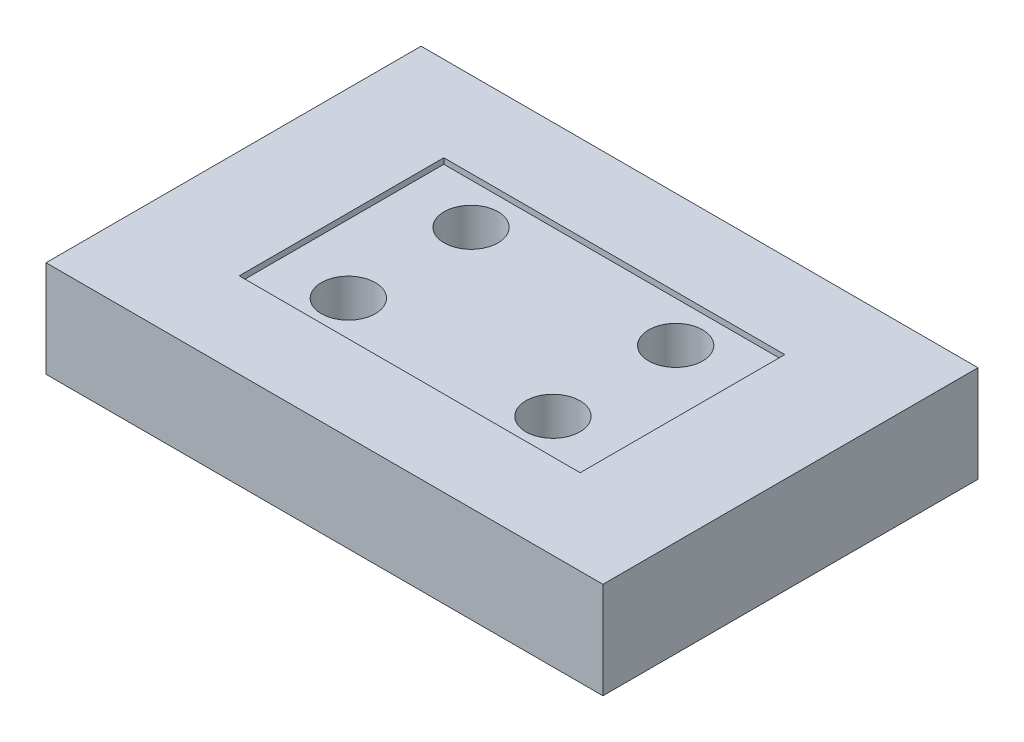
ISO-10303-21;
HEADER;
FILE_DESCRIPTION(('STEP AP214'),'2;1');
FILE_NAME('part.step','',(''),(''),'','','');
FILE_SCHEMA(('AUTOMOTIVE_DESIGN { 1 0 10303 214 1 1 1 1 }'));
ENDSEC;
DATA;
#1=APPLICATION_CONTEXT('core data for automotive mechanical design processes');
#2=APPLICATION_PROTOCOL_DEFINITION('international standard','automotive_design',2000,#1);
#3=PRODUCT_CONTEXT('',#1,'mechanical');
#4=PRODUCT('Part','Part','',(#3));
#5=PRODUCT_RELATED_PRODUCT_CATEGORY('part','',(#4));
#6=PRODUCT_DEFINITION_FORMATION('','',#4);
#7=PRODUCT_DEFINITION_CONTEXT('part definition',#1,'design');
#8=PRODUCT_DEFINITION('design','',#6,#7);
#9=PRODUCT_DEFINITION_SHAPE('','',#8);
#10=(LENGTH_UNIT() NAMED_UNIT(*) SI_UNIT(.MILLI.,.METRE.));
#11=(NAMED_UNIT(*) PLANE_ANGLE_UNIT() SI_UNIT($,.RADIAN.));
#12=(NAMED_UNIT(*) SI_UNIT($,.STERADIAN.) SOLID_ANGLE_UNIT());
#13=UNCERTAINTY_MEASURE_WITH_UNIT(LENGTH_MEASURE(1.E-05),#10,'distance_accuracy_value','');
#14=(GEOMETRIC_REPRESENTATION_CONTEXT(3) GLOBAL_UNCERTAINTY_ASSIGNED_CONTEXT((#13)) GLOBAL_UNIT_ASSIGNED_CONTEXT((#10,
#11,#12)) REPRESENTATION_CONTEXT('',''));
#15=CARTESIAN_POINT('',(0.,0.,0.));
#16=DIRECTION('',(0.,0.,1.));
#17=DIRECTION('',(1.,0.,0.));
#18=AXIS2_PLACEMENT_3D('',#15,#16,#17);
#19=CARTESIAN_POINT('',(-114.3,0.,-68.58));
#20=DIRECTION('',(0.,1.,0.));
#21=DIRECTION('',(0.,0.,1.));
#22=AXIS2_PLACEMENT_3D('',#19,#20,#21);
#23=CYLINDRICAL_SURFACE('',#22,30.1625);
#24=CARTESIAN_POINT('',(-114.3,0.,-68.58));
#25=DIRECTION('',(0.,1.,0.));
#26=DIRECTION('',(0.,0.,1.));
#27=AXIS2_PLACEMENT_3D('',#24,#25,#26);
#28=CIRCLE('',#27,30.1625);
#29=CARTESIAN_POINT('',(-114.3,0.,-38.4175));
#30=VERTEX_POINT('',#29);
#31=EDGE_CURVE('E178',#30,#30,#28,.T.);
#32=ORIENTED_EDGE('',*,*,#31,.F.);
#33=EDGE_LOOP('',(#32));
#34=FACE_BOUND('',#33,.T.);
#35=CARTESIAN_POINT('',(-114.3,101.6,-68.58));
#36=DIRECTION('',(0.,1.,0.));
#37=DIRECTION('',(0.,0.,1.));
#38=AXIS2_PLACEMENT_3D('',#35,#36,#37);
#39=CIRCLE('',#38,30.1625);
#40=CARTESIAN_POINT('',(-114.3,101.6,-38.4175));
#41=VERTEX_POINT('',#40);
#42=EDGE_CURVE('E168',#41,#41,#39,.F.);
#43=ORIENTED_EDGE('',*,*,#42,.F.);
#44=EDGE_LOOP('',(#43));
#45=FACE_BOUND('',#44,.T.);
#46=ADVANCED_FACE('F48',(#34,#45),#23,.F.);
#47=CARTESIAN_POINT('',(114.3,0.,68.5799999999991));
#48=DIRECTION('',(0.,1.,0.));
#49=DIRECTION('',(0.,0.,1.));
#50=AXIS2_PLACEMENT_3D('',#47,#48,#49);
#51=CYLINDRICAL_SURFACE('',#50,30.1625);
#52=CARTESIAN_POINT('',(114.3,0.,68.5799999999991));
#53=DIRECTION('',(0.,1.,0.));
#54=DIRECTION('',(0.,0.,1.));
#55=AXIS2_PLACEMENT_3D('',#52,#53,#54);
#56=CIRCLE('',#55,30.1625);
#57=CARTESIAN_POINT('',(114.3,0.,98.7424999999991));
#58=VERTEX_POINT('',#57);
#59=EDGE_CURVE('E171',#58,#58,#56,.T.);
#60=ORIENTED_EDGE('',*,*,#59,.F.);
#61=EDGE_LOOP('',(#60));
#62=FACE_BOUND('',#61,.T.);
#63=CARTESIAN_POINT('',(114.3,101.6,68.5799999999991));
#64=DIRECTION('',(0.,1.,0.));
#65=DIRECTION('',(0.,0.,1.));
#66=AXIS2_PLACEMENT_3D('',#63,#64,#65);
#67=CIRCLE('',#66,30.1625);
#68=CARTESIAN_POINT('',(114.3,101.6,98.7424999999991));
#69=VERTEX_POINT('',#68);
#70=EDGE_CURVE('E165',#69,#69,#67,.F.);
#71=ORIENTED_EDGE('',*,*,#70,.F.);
#72=EDGE_LOOP('',(#71));
#73=FACE_BOUND('',#72,.T.);
#74=ADVANCED_FACE('F227',(#62,#73),#51,.F.);
#75=CARTESIAN_POINT('',(114.299999999999,0.,-68.5800000000009));
#76=DIRECTION('',(0.,1.,0.));
#77=DIRECTION('',(0.,0.,1.));
#78=AXIS2_PLACEMENT_3D('',#75,#76,#77);
#79=CYLINDRICAL_SURFACE('',#78,30.1624999999999);
#80=CARTESIAN_POINT('',(114.299999999999,0.,-68.5800000000009));
#81=DIRECTION('',(0.,1.,0.));
#82=DIRECTION('',(0.,0.,-1.));
#83=AXIS2_PLACEMENT_3D('',#80,#81,#82);
#84=CIRCLE('',#83,30.1624999999999);
#85=CARTESIAN_POINT('',(114.299999999999,0.,-98.7425000000008));
#86=VERTEX_POINT('',#85);
#87=EDGE_CURVE('E174',#86,#86,#84,.T.);
#88=ORIENTED_EDGE('',*,*,#87,.F.);
#89=EDGE_LOOP('',(#88));
#90=FACE_BOUND('',#89,.T.);
#91=CARTESIAN_POINT('',(114.299999999999,101.6,-68.5800000000009));
#92=DIRECTION('',(0.,1.,0.));
#93=DIRECTION('',(0.,0.,1.));
#94=AXIS2_PLACEMENT_3D('',#91,#92,#93);
#95=CIRCLE('',#94,30.1624999999999);
#96=CARTESIAN_POINT('',(114.299999999999,101.6,-38.417500000001));
#97=VERTEX_POINT('',#96);
#98=EDGE_CURVE('E162',#97,#97,#95,.F.);
#99=ORIENTED_EDGE('',*,*,#98,.F.);
#100=EDGE_LOOP('',(#99));
#101=FACE_BOUND('',#100,.T.);
#102=ADVANCED_FACE('F233',(#90,#101),#79,.F.);
#103=CARTESIAN_POINT('',(-114.3,0.,68.58));
#104=DIRECTION('',(0.,1.,0.));
#105=DIRECTION('',(0.,0.,1.));
#106=AXIS2_PLACEMENT_3D('',#103,#104,#105);
#107=CYLINDRICAL_SURFACE('',#106,30.1625);
#108=CARTESIAN_POINT('',(-114.3,0.,68.58));
#109=DIRECTION('',(0.,1.,0.));
#110=DIRECTION('',(0.,0.,-1.));
#111=AXIS2_PLACEMENT_3D('',#108,#109,#110);
#112=CIRCLE('',#111,30.1625);
#113=CARTESIAN_POINT('',(-114.3,0.,38.4175));
#114=VERTEX_POINT('',#113);
#115=EDGE_CURVE('E175',#114,#114,#112,.T.);
#116=ORIENTED_EDGE('',*,*,#115,.F.);
#117=EDGE_LOOP('',(#116));
#118=FACE_BOUND('',#117,.T.);
#119=CARTESIAN_POINT('',(-114.3,101.6,68.58));
#120=DIRECTION('',(0.,1.,0.));
#121=DIRECTION('',(0.,0.,1.));
#122=AXIS2_PLACEMENT_3D('',#119,#120,#121);
#123=CIRCLE('',#122,30.1625);
#124=CARTESIAN_POINT('',(-114.3,101.6,98.7425));
#125=VERTEX_POINT('',#124);
#126=EDGE_CURVE('E52',#125,#125,#123,.F.);
#127=ORIENTED_EDGE('',*,*,#126,.F.);
#128=EDGE_LOOP('',(#127));
#129=FACE_BOUND('',#128,.T.);
#130=ADVANCED_FACE('F260',(#118,#129),#107,.F.);
#131=CARTESIAN_POINT('',(-311.15,107.95,209.55));
#132=DIRECTION('',(1.,0.,0.));
#133=DIRECTION('',(0.,0.,-1.));
#134=AXIS2_PLACEMENT_3D('',#131,#132,#133);
#135=PLANE('',#134);
#136=DIRECTION('',(0.,0.,1.));
#137=VECTOR('',#136,1.);
#138=CARTESIAN_POINT('',(-311.15,0.,209.55));
#139=LINE('',#138,#137);
#140=CARTESIAN_POINT('',(-311.15,0.,-209.55));
#141=VERTEX_POINT('',#140);
#142=CARTESIAN_POINT('',(-311.15,0.,209.55));
#143=VERTEX_POINT('',#142);
#144=EDGE_CURVE('E183',#141,#143,#139,.T.);
#145=ORIENTED_EDGE('',*,*,#144,.T.);
#146=DIRECTION('',(0.,-1.,0.));
#147=VECTOR('',#146,1.);
#148=CARTESIAN_POINT('',(-311.15,107.95,209.55));
#149=LINE('',#148,#147);
#150=CARTESIAN_POINT('',(-311.15,107.95,209.55));
#151=VERTEX_POINT('',#150);
#152=EDGE_CURVE('E13',#151,#143,#149,.T.);
#153=ORIENTED_EDGE('',*,*,#152,.F.);
#154=DIRECTION('',(0.,0.,1.));
#155=VECTOR('',#154,1.);
#156=CARTESIAN_POINT('',(-311.15,107.95,209.55));
#157=LINE('',#156,#155);
#158=CARTESIAN_POINT('',(-311.15,107.95,-209.55));
#159=VERTEX_POINT('',#158);
#160=EDGE_CURVE('E184',#159,#151,#157,.T.);
#161=ORIENTED_EDGE('',*,*,#160,.F.);
#162=DIRECTION('',(0.,-1.,0.));
#163=VECTOR('',#162,1.);
#164=CARTESIAN_POINT('',(-311.15,107.95,-209.55));
#165=LINE('',#164,#163);
#166=EDGE_CURVE('E190',#159,#141,#165,.T.);
#167=ORIENTED_EDGE('',*,*,#166,.T.);
#168=EDGE_LOOP('',(#145,#153,#161,#167));
#169=FACE_BOUND('',#168,.T.);
#170=ADVANCED_FACE('F50',(#169),#135,.F.);
#171=CARTESIAN_POINT('',(311.15,107.95,209.55));
#172=DIRECTION('',(0.,0.,-1.));
#173=DIRECTION('',(-1.,0.,0.));
#174=AXIS2_PLACEMENT_3D('',#171,#172,#173);
#175=PLANE('',#174);
#176=DIRECTION('',(1.,0.,0.));
#177=VECTOR('',#176,1.);
#178=CARTESIAN_POINT('',(311.15,0.,209.55));
#179=LINE('',#178,#177);
#180=CARTESIAN_POINT('',(311.15,0.,209.55));
#181=VERTEX_POINT('',#180);
#182=EDGE_CURVE('E193',#143,#181,#179,.T.);
#183=ORIENTED_EDGE('',*,*,#182,.T.);
#184=DIRECTION('',(0.,-1.,0.));
#185=VECTOR('',#184,1.);
#186=CARTESIAN_POINT('',(311.15,107.95,209.55));
#187=LINE('',#186,#185);
#188=CARTESIAN_POINT('',(311.15,107.95,209.55));
#189=VERTEX_POINT('',#188);
#190=EDGE_CURVE('E57',#189,#181,#187,.T.);
#191=ORIENTED_EDGE('',*,*,#190,.F.);
#192=DIRECTION('',(1.,0.,0.));
#193=VECTOR('',#192,1.);
#194=CARTESIAN_POINT('',(311.15,107.95,209.55));
#195=LINE('',#194,#193);
#196=EDGE_CURVE('E101',#151,#189,#195,.T.);
#197=ORIENTED_EDGE('',*,*,#196,.F.);
#198=ORIENTED_EDGE('',*,*,#152,.T.);
#199=EDGE_LOOP('',(#183,#191,#197,#198));
#200=FACE_BOUND('',#199,.T.);
#201=ADVANCED_FACE('F223',(#200),#175,.F.);
#202=CARTESIAN_POINT('',(311.15,107.95,209.55));
#203=DIRECTION('',(-1.,0.,0.));
#204=DIRECTION('',(0.,0.,1.));
#205=AXIS2_PLACEMENT_3D('',#202,#203,#204);
#206=PLANE('',#205);
#207=DIRECTION('',(0.,0.,-1.));
#208=VECTOR('',#207,1.);
#209=CARTESIAN_POINT('',(311.15,0.,209.55));
#210=LINE('',#209,#208);
#211=CARTESIAN_POINT('',(311.15,0.,-209.55));
#212=VERTEX_POINT('',#211);
#213=EDGE_CURVE('E195',#181,#212,#210,.T.);
#214=ORIENTED_EDGE('',*,*,#213,.T.);
#215=DIRECTION('',(0.,-1.,0.));
#216=VECTOR('',#215,1.);
#217=CARTESIAN_POINT('',(311.15,107.95,-209.55));
#218=LINE('',#217,#216);
#219=CARTESIAN_POINT('',(311.15,107.95,-209.55));
#220=VERTEX_POINT('',#219);
#221=EDGE_CURVE('E199',#220,#212,#218,.T.);
#222=ORIENTED_EDGE('',*,*,#221,.F.);
#223=DIRECTION('',(0.,0.,-1.));
#224=VECTOR('',#223,1.);
#225=CARTESIAN_POINT('',(311.15,107.95,209.55));
#226=LINE('',#225,#224);
#227=EDGE_CURVE('E187',#189,#220,#226,.T.);
#228=ORIENTED_EDGE('',*,*,#227,.F.);
#229=ORIENTED_EDGE('',*,*,#190,.T.);
#230=EDGE_LOOP('',(#214,#222,#228,#229));
#231=FACE_BOUND('',#230,.T.);
#232=ADVANCED_FACE('F205',(#231),#206,.F.);
#233=CARTESIAN_POINT('',(311.15,107.95,-209.55));
#234=DIRECTION('',(0.,0.,1.));
#235=DIRECTION('',(1.,0.,0.));
#236=AXIS2_PLACEMENT_3D('',#233,#234,#235);
#237=PLANE('',#236);
#238=DIRECTION('',(-1.,0.,0.));
#239=VECTOR('',#238,1.);
#240=CARTESIAN_POINT('',(311.15,0.,-209.55));
#241=LINE('',#240,#239);
#242=EDGE_CURVE('E94',#212,#141,#241,.T.);
#243=ORIENTED_EDGE('',*,*,#242,.T.);
#244=ORIENTED_EDGE('',*,*,#166,.F.);
#245=DIRECTION('',(-1.,0.,0.));
#246=VECTOR('',#245,1.);
#247=CARTESIAN_POINT('',(311.15,107.95,-209.55));
#248=LINE('',#247,#246);
#249=EDGE_CURVE('E73',#220,#159,#248,.T.);
#250=ORIENTED_EDGE('',*,*,#249,.F.);
#251=ORIENTED_EDGE('',*,*,#221,.T.);
#252=EDGE_LOOP('',(#243,#244,#250,#251));
#253=FACE_BOUND('',#252,.T.);
#254=ADVANCED_FACE('F213',(#253),#237,.F.);
#255=CARTESIAN_POINT('',(0.,107.95,0.));
#256=DIRECTION('',(0.,1.,0.));
#257=DIRECTION('',(0.,0.,1.));
#258=AXIS2_PLACEMENT_3D('',#255,#256,#257);
#259=PLANE('',#258);
#260=DIRECTION('',(0.,0.,1.));
#261=VECTOR('',#260,1.);
#262=CARTESIAN_POINT('',(-190.5,107.95,114.3));
#263=LINE('',#262,#261);
#264=CARTESIAN_POINT('',(-190.5,107.95,-114.3));
#265=VERTEX_POINT('',#264);
#266=CARTESIAN_POINT('',(-190.5,107.95,114.3));
#267=VERTEX_POINT('',#266);
#268=EDGE_CURVE('E64',#265,#267,#263,.T.);
#269=ORIENTED_EDGE('',*,*,#268,.F.);
#270=DIRECTION('',(-1.,0.,0.));
#271=VECTOR('',#270,1.);
#272=CARTESIAN_POINT('',(190.5,107.95,-114.3));
#273=LINE('',#272,#271);
#274=CARTESIAN_POINT('',(190.5,107.95,-114.3));
#275=VERTEX_POINT('',#274);
#276=EDGE_CURVE('E144',#275,#265,#273,.T.);
#277=ORIENTED_EDGE('',*,*,#276,.F.);
#278=DIRECTION('',(0.,0.,-1.));
#279=VECTOR('',#278,1.);
#280=CARTESIAN_POINT('',(190.5,107.95,114.3));
#281=LINE('',#280,#279);
#282=CARTESIAN_POINT('',(190.5,107.95,114.3));
#283=VERTEX_POINT('',#282);
#284=EDGE_CURVE('E147',#283,#275,#281,.T.);
#285=ORIENTED_EDGE('',*,*,#284,.F.);
#286=DIRECTION('',(1.,0.,0.));
#287=VECTOR('',#286,1.);
#288=CARTESIAN_POINT('',(190.5,107.95,114.3));
#289=LINE('',#288,#287);
#290=EDGE_CURVE('E153',#267,#283,#289,.T.);
#291=ORIENTED_EDGE('',*,*,#290,.F.);
#292=EDGE_LOOP('',(#269,#277,#285,#291));
#293=FACE_BOUND('',#292,.T.);
#294=ORIENTED_EDGE('',*,*,#160,.T.);
#295=ORIENTED_EDGE('',*,*,#196,.T.);
#296=ORIENTED_EDGE('',*,*,#227,.T.);
#297=ORIENTED_EDGE('',*,*,#249,.T.);
#298=EDGE_LOOP('',(#294,#295,#296,#297));
#299=FACE_BOUND('',#298,.T.);
#300=ADVANCED_FACE('F215',(#293,#299),#259,.T.);
#301=CARTESIAN_POINT('',(0.,0.,0.));
#302=DIRECTION('',(0.,1.,0.));
#303=DIRECTION('',(0.,0.,1.));
#304=AXIS2_PLACEMENT_3D('',#301,#302,#303);
#305=PLANE('',#304);
#306=ORIENTED_EDGE('',*,*,#115,.T.);
#307=EDGE_LOOP('',(#306));
#308=FACE_BOUND('',#307,.T.);
#309=ORIENTED_EDGE('',*,*,#87,.T.);
#310=EDGE_LOOP('',(#309));
#311=FACE_BOUND('',#310,.T.);
#312=ORIENTED_EDGE('',*,*,#59,.T.);
#313=EDGE_LOOP('',(#312));
#314=FACE_BOUND('',#313,.T.);
#315=ORIENTED_EDGE('',*,*,#31,.T.);
#316=EDGE_LOOP('',(#315));
#317=FACE_BOUND('',#316,.T.);
#318=ORIENTED_EDGE('',*,*,#144,.F.);
#319=ORIENTED_EDGE('',*,*,#242,.F.);
#320=ORIENTED_EDGE('',*,*,#213,.F.);
#321=ORIENTED_EDGE('',*,*,#182,.F.);
#322=EDGE_LOOP('',(#318,#319,#320,#321));
#323=FACE_BOUND('',#322,.T.);
#324=ADVANCED_FACE('F209',(#308,#311,#314,#317,#323),#305,.F.);
#325=CARTESIAN_POINT('',(0.,101.6,0.));
#326=DIRECTION('',(0.,1.,0.));
#327=DIRECTION('',(0.,0.,1.));
#328=AXIS2_PLACEMENT_3D('',#325,#326,#327);
#329=PLANE('',#328);
#330=DIRECTION('',(0.,0.,1.));
#331=VECTOR('',#330,1.);
#332=CARTESIAN_POINT('',(-190.5,101.6,114.3));
#333=LINE('',#332,#331);
#334=CARTESIAN_POINT('',(-190.5,101.6,-114.3));
#335=VERTEX_POINT('',#334);
#336=CARTESIAN_POINT('',(-190.5,101.6,114.3));
#337=VERTEX_POINT('',#336);
#338=EDGE_CURVE('E125',#335,#337,#333,.T.);
#339=ORIENTED_EDGE('',*,*,#338,.T.);
#340=DIRECTION('',(1.,0.,0.));
#341=VECTOR('',#340,1.);
#342=CARTESIAN_POINT('',(190.5,101.6,114.3));
#343=LINE('',#342,#341);
#344=CARTESIAN_POINT('',(190.5,101.6,114.3));
#345=VERTEX_POINT('',#344);
#346=EDGE_CURVE('E134',#337,#345,#343,.T.);
#347=ORIENTED_EDGE('',*,*,#346,.T.);
#348=DIRECTION('',(0.,0.,-1.));
#349=VECTOR('',#348,1.);
#350=CARTESIAN_POINT('',(190.5,101.6,114.3));
#351=LINE('',#350,#349);
#352=CARTESIAN_POINT('',(190.5,101.6,-114.3));
#353=VERTEX_POINT('',#352);
#354=EDGE_CURVE('E139',#345,#353,#351,.T.);
#355=ORIENTED_EDGE('',*,*,#354,.T.);
#356=DIRECTION('',(-1.,0.,0.));
#357=VECTOR('',#356,1.);
#358=CARTESIAN_POINT('',(190.5,101.6,-114.3));
#359=LINE('',#358,#357);
#360=EDGE_CURVE('E131',#353,#335,#359,.T.);
#361=ORIENTED_EDGE('',*,*,#360,.T.);
#362=EDGE_LOOP('',(#339,#347,#355,#361));
#363=FACE_BOUND('',#362,.T.);
#364=ORIENTED_EDGE('',*,*,#126,.T.);
#365=EDGE_LOOP('',(#364));
#366=FACE_BOUND('',#365,.T.);
#367=ORIENTED_EDGE('',*,*,#98,.T.);
#368=EDGE_LOOP('',(#367));
#369=FACE_BOUND('',#368,.T.);
#370=ORIENTED_EDGE('',*,*,#70,.T.);
#371=EDGE_LOOP('',(#370));
#372=FACE_BOUND('',#371,.T.);
#373=ORIENTED_EDGE('',*,*,#42,.T.);
#374=EDGE_LOOP('',(#373));
#375=FACE_BOUND('',#374,.T.);
#376=ADVANCED_FACE('F141',(#363,#366,#369,#372,#375),#329,.T.);
#377=CARTESIAN_POINT('',(-190.5,101.6,114.3));
#378=DIRECTION('',(-1.,0.,0.));
#379=DIRECTION('',(0.,0.,1.));
#380=AXIS2_PLACEMENT_3D('',#377,#378,#379);
#381=PLANE('',#380);
#382=ORIENTED_EDGE('',*,*,#268,.T.);
#383=DIRECTION('',(0.,1.,0.));
#384=VECTOR('',#383,1.);
#385=CARTESIAN_POINT('',(-190.5,101.6,114.3));
#386=LINE('',#385,#384);
#387=EDGE_CURVE('E121',#337,#267,#386,.T.);
#388=ORIENTED_EDGE('',*,*,#387,.F.);
#389=ORIENTED_EDGE('',*,*,#338,.F.);
#390=DIRECTION('',(0.,1.,0.));
#391=VECTOR('',#390,1.);
#392=CARTESIAN_POINT('',(-190.5,101.6,-114.3));
#393=LINE('',#392,#391);
#394=EDGE_CURVE('E157',#335,#265,#393,.T.);
#395=ORIENTED_EDGE('',*,*,#394,.T.);
#396=EDGE_LOOP('',(#382,#388,#389,#395));
#397=FACE_BOUND('',#396,.T.);
#398=ADVANCED_FACE('F123',(#397),#381,.F.);
#399=CARTESIAN_POINT('',(190.5,101.6,-114.3));
#400=DIRECTION('',(0.,0.,-1.));
#401=DIRECTION('',(-1.,0.,0.));
#402=AXIS2_PLACEMENT_3D('',#399,#400,#401);
#403=PLANE('',#402);
#404=ORIENTED_EDGE('',*,*,#276,.T.);
#405=ORIENTED_EDGE('',*,*,#394,.F.);
#406=ORIENTED_EDGE('',*,*,#360,.F.);
#407=DIRECTION('',(0.,1.,0.));
#408=VECTOR('',#407,1.);
#409=CARTESIAN_POINT('',(190.5,101.6,-114.3));
#410=LINE('',#409,#408);
#411=EDGE_CURVE('E159',#353,#275,#410,.T.);
#412=ORIENTED_EDGE('',*,*,#411,.T.);
#413=EDGE_LOOP('',(#404,#405,#406,#412));
#414=FACE_BOUND('',#413,.T.);
#415=ADVANCED_FACE('F274',(#414),#403,.F.);
#416=CARTESIAN_POINT('',(190.5,101.6,114.3));
#417=DIRECTION('',(1.,0.,0.));
#418=DIRECTION('',(0.,0.,-1.));
#419=AXIS2_PLACEMENT_3D('',#416,#417,#418);
#420=PLANE('',#419);
#421=ORIENTED_EDGE('',*,*,#284,.T.);
#422=ORIENTED_EDGE('',*,*,#411,.F.);
#423=ORIENTED_EDGE('',*,*,#354,.F.);
#424=DIRECTION('',(0.,1.,0.));
#425=VECTOR('',#424,1.);
#426=CARTESIAN_POINT('',(190.5,101.6,114.3));
#427=LINE('',#426,#425);
#428=EDGE_CURVE('E130',#345,#283,#427,.T.);
#429=ORIENTED_EDGE('',*,*,#428,.T.);
#430=EDGE_LOOP('',(#421,#422,#423,#429));
#431=FACE_BOUND('',#430,.T.);
#432=ADVANCED_FACE('F277',(#431),#420,.F.);
#433=CARTESIAN_POINT('',(190.5,101.6,114.3));
#434=DIRECTION('',(0.,0.,1.));
#435=DIRECTION('',(1.,0.,0.));
#436=AXIS2_PLACEMENT_3D('',#433,#434,#435);
#437=PLANE('',#436);
#438=ORIENTED_EDGE('',*,*,#290,.T.);
#439=ORIENTED_EDGE('',*,*,#428,.F.);
#440=ORIENTED_EDGE('',*,*,#346,.F.);
#441=ORIENTED_EDGE('',*,*,#387,.T.);
#442=EDGE_LOOP('',(#438,#439,#440,#441));
#443=FACE_BOUND('',#442,.T.);
#444=ADVANCED_FACE('F135',(#443),#437,.F.);
#445=CLOSED_SHELL('',(#46,#74,#102,#130,#170,#201,#232,#254,#300,#324,#376,#398,#415,#432,#444));
#446=MANIFOLD_SOLID_BREP('B2',#445);
#447=ADVANCED_BREP_SHAPE_REPRESENTATION('',(#18,#446),#14);
#448=SHAPE_DEFINITION_REPRESENTATION(#9,#447);
ENDSEC;
END-ISO-10303-21;
